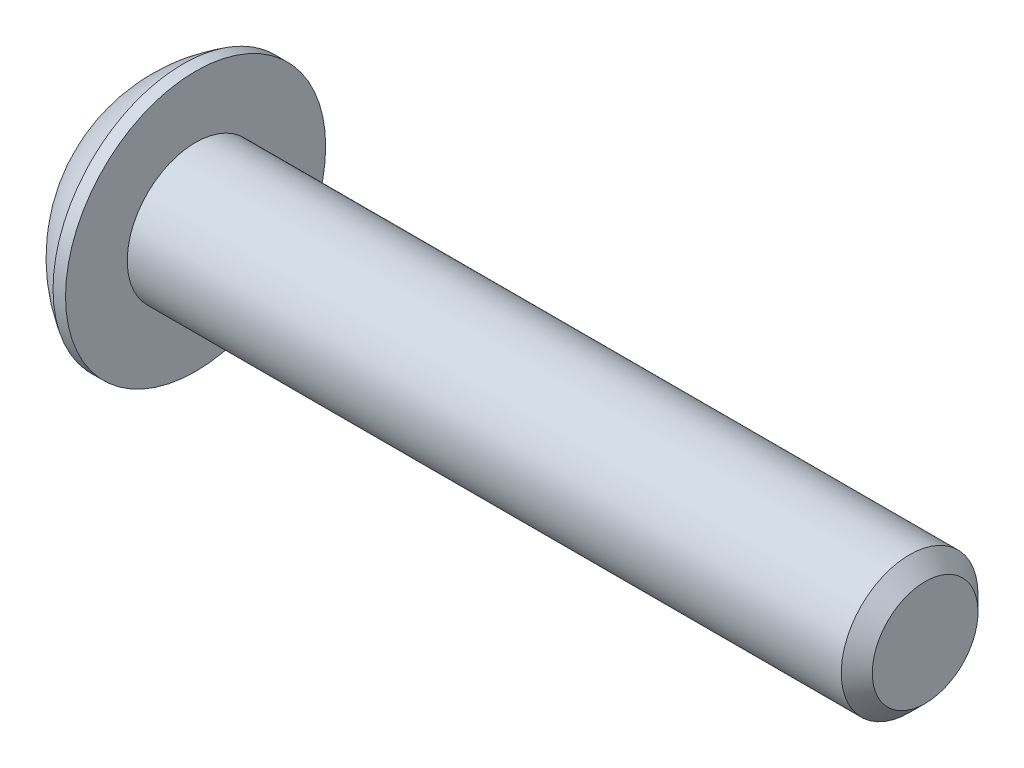
ISO-10303-21;
HEADER;
FILE_DESCRIPTION(('STEP AP214'),'2;1');
FILE_NAME('part.step','',(''),(''),'','','');
FILE_SCHEMA(('AUTOMOTIVE_DESIGN { 1 0 10303 214 1 1 1 1 }'));
ENDSEC;
DATA;
#1=APPLICATION_CONTEXT('core data for automotive mechanical design processes');
#2=APPLICATION_PROTOCOL_DEFINITION('international standard','automotive_design',2000,#1);
#3=PRODUCT_CONTEXT('',#1,'mechanical');
#4=PRODUCT('Part','Part','',(#3));
#5=PRODUCT_RELATED_PRODUCT_CATEGORY('part','',(#4));
#6=PRODUCT_DEFINITION_FORMATION('','',#4);
#7=PRODUCT_DEFINITION_CONTEXT('part definition',#1,'design');
#8=PRODUCT_DEFINITION('design','',#6,#7);
#9=PRODUCT_DEFINITION_SHAPE('','',#8);
#10=(LENGTH_UNIT() NAMED_UNIT(*) SI_UNIT(.MILLI.,.METRE.));
#11=(NAMED_UNIT(*) PLANE_ANGLE_UNIT() SI_UNIT($,.RADIAN.));
#12=(NAMED_UNIT(*) SI_UNIT($,.STERADIAN.) SOLID_ANGLE_UNIT());
#13=UNCERTAINTY_MEASURE_WITH_UNIT(LENGTH_MEASURE(1.E-05),#10,'distance_accuracy_value','');
#14=(GEOMETRIC_REPRESENTATION_CONTEXT(3) GLOBAL_UNCERTAINTY_ASSIGNED_CONTEXT((#13)) GLOBAL_UNIT_ASSIGNED_CONTEXT((#10,
#11,#12)) REPRESENTATION_CONTEXT('',''));
#15=CARTESIAN_POINT('',(0.,0.,0.));
#16=DIRECTION('',(0.,0.,1.));
#17=DIRECTION('',(1.,0.,0.));
#18=AXIS2_PLACEMENT_3D('',#15,#16,#17);
#19=CARTESIAN_POINT('',(1.32080000000034,0.,0.));
#20=DIRECTION('',(-1.,0.,0.));
#21=DIRECTION('',(0.,0.,-1.));
#22=AXIS2_PLACEMENT_3D('',#19,#20,#21);
#23=CONICAL_SURFACE('',#22,1.1937999999998,1.04719755119608);
#24=CARTESIAN_POINT('',(2.01004075135902,0.,-4.44089209850063E-13));
#25=VERTEX_POINT('',#24);
#26=VERTEX_LOOP('',#25);
#27=FACE_BOUND('',#26,.T.);
#28=CARTESIAN_POINT('',(1.32080000000009,0.,0.));
#29=DIRECTION('',(1.,0.,0.));
#30=DIRECTION('',(0.,0.,-1.));
#31=AXIS2_PLACEMENT_3D('',#28,#29,#30);
#32=CIRCLE('',#31,1.19380000000024);
#33=CARTESIAN_POINT('',(1.32080000000004,-1.03386112703797,-0.59690000000006));
#34=VERTEX_POINT('',#33);
#35=CARTESIAN_POINT('',(1.32080000000004,0.,-1.19380000000012));
#36=VERTEX_POINT('',#35);
#37=EDGE_CURVE('E37',#34,#36,#32,.T.);
#38=ORIENTED_EDGE('',*,*,#37,.F.);
#39=CARTESIAN_POINT('',(1.32080000000009,0.,0.));
#40=DIRECTION('',(1.,0.,0.));
#41=DIRECTION('',(0.,0.,-1.));
#42=AXIS2_PLACEMENT_3D('',#39,#40,#41);
#43=CIRCLE('',#42,1.19380000000024);
#44=CARTESIAN_POINT('',(1.32080000000004,-1.03386112703797,0.59690000000006));
#45=VERTEX_POINT('',#44);
#46=EDGE_CURVE('E127',#45,#34,#43,.T.);
#47=ORIENTED_EDGE('',*,*,#46,.F.);
#48=CARTESIAN_POINT('',(1.32080000000009,0.,0.));
#49=DIRECTION('',(1.,0.,0.));
#50=DIRECTION('',(0.,0.,-1.));
#51=AXIS2_PLACEMENT_3D('',#48,#49,#50);
#52=CIRCLE('',#51,1.19380000000024);
#53=CARTESIAN_POINT('',(1.32080000000004,1.49457637585666E-12,1.19380000000012));
#54=VERTEX_POINT('',#53);
#55=EDGE_CURVE('E133',#54,#45,#52,.T.);
#56=ORIENTED_EDGE('',*,*,#55,.F.);
#57=CARTESIAN_POINT('',(1.32080000000009,0.,0.));
#58=DIRECTION('',(1.,0.,0.));
#59=DIRECTION('',(0.,0.,-1.));
#60=AXIS2_PLACEMENT_3D('',#57,#58,#59);
#61=CIRCLE('',#60,1.19380000000024);
#62=CARTESIAN_POINT('',(1.32080000000004,1.03386112703797,0.596900000000061));
#63=VERTEX_POINT('',#62);
#64=EDGE_CURVE('E147',#63,#54,#61,.T.);
#65=ORIENTED_EDGE('',*,*,#64,.F.);
#66=CARTESIAN_POINT('',(1.32080000000009,0.,0.));
#67=DIRECTION('',(1.,0.,0.));
#68=DIRECTION('',(0.,0.,-1.));
#69=AXIS2_PLACEMENT_3D('',#66,#67,#68);
#70=CIRCLE('',#69,1.19380000000024);
#71=CARTESIAN_POINT('',(1.32080000000004,1.03386112703797,-0.596900000000061));
#72=VERTEX_POINT('',#71);
#73=EDGE_CURVE('E140',#72,#63,#70,.T.);
#74=ORIENTED_EDGE('',*,*,#73,.F.);
#75=CARTESIAN_POINT('',(1.32080000000009,0.,0.));
#76=DIRECTION('',(1.,0.,0.));
#77=DIRECTION('',(0.,0.,-1.));
#78=AXIS2_PLACEMENT_3D('',#75,#76,#77);
#79=CIRCLE('',#78,1.19380000000024);
#80=EDGE_CURVE('E137',#36,#72,#79,.T.);
#81=ORIENTED_EDGE('',*,*,#80,.F.);
#82=EDGE_LOOP('',(#38,#47,#56,#65,#74,#81));
#83=FACE_BOUND('',#82,.T.);
#84=ADVANCED_FACE('F34',(#27,#83),#23,.F.);
#85=CARTESIAN_POINT('',(1.3208,-2.06772225407572,1.1938));
#86=DIRECTION('',(1.,0.,0.));
#87=DIRECTION('',(0.,0.,1.));
#88=AXIS2_PLACEMENT_3D('',#85,#86,#87);
#89=PLANE('',#88);
#90=DIRECTION('',(0.,0.5,-0.866025403784439));
#91=VECTOR('',#90,1.);
#92=CARTESIAN_POINT('',(1.3208,-1.37848150271715,0.));
#93=LINE('',#92,#91);
#94=CARTESIAN_POINT('',(1.3208,-0.689240751358574,-1.1938));
#95=VERTEX_POINT('',#94);
#96=EDGE_CURVE('E109',#95,#34,#93,.F.);
#97=ORIENTED_EDGE('',*,*,#96,.T.);
#98=ORIENTED_EDGE('',*,*,#37,.T.);
#99=DIRECTION('',(0.,1.,0.));
#100=VECTOR('',#99,1.);
#101=CARTESIAN_POINT('',(1.3208,-0.689240751358574,-1.1938));
#102=LINE('',#101,#100);
#103=EDGE_CURVE('E124',#36,#95,#102,.F.);
#104=ORIENTED_EDGE('',*,*,#103,.T.);
#105=EDGE_LOOP('',(#97,#98,#104));
#106=FACE_BOUND('',#105,.T.);
#107=ADVANCED_FACE('F121',(#106),#89,.F.);
#108=CARTESIAN_POINT('',(1.3208,-2.06772225407572,1.1938));
#109=DIRECTION('',(1.,0.,0.));
#110=DIRECTION('',(0.,0.,1.));
#111=AXIS2_PLACEMENT_3D('',#108,#109,#110);
#112=PLANE('',#111);
#113=DIRECTION('',(0.,-0.5,-0.866025403784439));
#114=VECTOR('',#113,1.);
#115=CARTESIAN_POINT('',(1.3208,-0.689240751358574,1.1938));
#116=LINE('',#115,#114);
#117=CARTESIAN_POINT('',(1.3208,-1.37848150271715,0.));
#118=VERTEX_POINT('',#117);
#119=EDGE_CURVE('E129',#118,#45,#116,.F.);
#120=ORIENTED_EDGE('',*,*,#119,.T.);
#121=ORIENTED_EDGE('',*,*,#46,.T.);
#122=DIRECTION('',(0.,0.5,-0.866025403784439));
#123=VECTOR('',#122,1.);
#124=CARTESIAN_POINT('',(1.3208,-1.37848150271715,0.));
#125=LINE('',#124,#123);
#126=EDGE_CURVE('E104',#34,#118,#125,.F.);
#127=ORIENTED_EDGE('',*,*,#126,.T.);
#128=EDGE_LOOP('',(#120,#121,#127));
#129=FACE_BOUND('',#128,.T.);
#130=ADVANCED_FACE('F128',(#129),#112,.F.);
#131=CARTESIAN_POINT('',(1.3208,-2.06772225407572,1.1938));
#132=DIRECTION('',(1.,0.,0.));
#133=DIRECTION('',(0.,0.,1.));
#134=AXIS2_PLACEMENT_3D('',#131,#132,#133);
#135=PLANE('',#134);
#136=DIRECTION('',(0.,1.,0.));
#137=VECTOR('',#136,1.);
#138=CARTESIAN_POINT('',(1.3208,0.689240751358577,1.1938));
#139=LINE('',#138,#137);
#140=CARTESIAN_POINT('',(1.3208,-0.689240751358574,1.1938));
#141=VERTEX_POINT('',#140);
#142=EDGE_CURVE('E166',#141,#54,#139,.T.);
#143=ORIENTED_EDGE('',*,*,#142,.T.);
#144=ORIENTED_EDGE('',*,*,#55,.T.);
#145=DIRECTION('',(0.,-0.5,-0.866025403784439));
#146=VECTOR('',#145,1.);
#147=CARTESIAN_POINT('',(1.3208,-0.689240751358574,1.1938));
#148=LINE('',#147,#146);
#149=EDGE_CURVE('E164',#45,#141,#148,.F.);
#150=ORIENTED_EDGE('',*,*,#149,.T.);
#151=EDGE_LOOP('',(#143,#144,#150));
#152=FACE_BOUND('',#151,.T.);
#153=ADVANCED_FACE('F163',(#152),#135,.F.);
#154=CARTESIAN_POINT('',(1.3208,-2.06772225407572,1.1938));
#155=DIRECTION('',(1.,0.,0.));
#156=DIRECTION('',(0.,0.,1.));
#157=AXIS2_PLACEMENT_3D('',#154,#155,#156);
#158=PLANE('',#157);
#159=DIRECTION('',(0.,-0.5,0.866025403784439));
#160=VECTOR('',#159,1.);
#161=CARTESIAN_POINT('',(1.3208,1.37848150271715,0.));
#162=LINE('',#161,#160);
#163=CARTESIAN_POINT('',(1.3208,0.689240751358577,1.1938));
#164=VERTEX_POINT('',#163);
#165=EDGE_CURVE('E173',#164,#63,#162,.F.);
#166=ORIENTED_EDGE('',*,*,#165,.T.);
#167=ORIENTED_EDGE('',*,*,#64,.T.);
#168=DIRECTION('',(0.,1.,0.));
#169=VECTOR('',#168,1.);
#170=CARTESIAN_POINT('',(1.3208,0.689240751358577,1.1938));
#171=LINE('',#170,#169);
#172=EDGE_CURVE('E171',#54,#164,#171,.T.);
#173=ORIENTED_EDGE('',*,*,#172,.T.);
#174=EDGE_LOOP('',(#166,#167,#173));
#175=FACE_BOUND('',#174,.T.);
#176=ADVANCED_FACE('F170',(#175),#158,.F.);
#177=CARTESIAN_POINT('',(1.3208,-2.06772225407572,1.1938));
#178=DIRECTION('',(1.,0.,0.));
#179=DIRECTION('',(0.,0.,1.));
#180=AXIS2_PLACEMENT_3D('',#177,#178,#179);
#181=PLANE('',#180);
#182=DIRECTION('',(0.,0.5,0.866025403784439));
#183=VECTOR('',#182,1.);
#184=CARTESIAN_POINT('',(1.3208,0.689240751358576,-1.1938));
#185=LINE('',#184,#183);
#186=CARTESIAN_POINT('',(1.3208,1.37848150271715,0.));
#187=VERTEX_POINT('',#186);
#188=EDGE_CURVE('E184',#187,#72,#185,.F.);
#189=ORIENTED_EDGE('',*,*,#188,.T.);
#190=ORIENTED_EDGE('',*,*,#73,.T.);
#191=DIRECTION('',(0.,-0.5,0.866025403784439));
#192=VECTOR('',#191,1.);
#193=CARTESIAN_POINT('',(1.3208,1.37848150271715,0.));
#194=LINE('',#193,#192);
#195=EDGE_CURVE('E176',#63,#187,#194,.F.);
#196=ORIENTED_EDGE('',*,*,#195,.T.);
#197=EDGE_LOOP('',(#189,#190,#196));
#198=FACE_BOUND('',#197,.T.);
#199=ADVANCED_FACE('F182',(#198),#181,.F.);
#200=CARTESIAN_POINT('',(1.3208,-2.06772225407572,1.1938));
#201=DIRECTION('',(1.,0.,0.));
#202=DIRECTION('',(0.,0.,1.));
#203=AXIS2_PLACEMENT_3D('',#200,#201,#202);
#204=PLANE('',#203);
#205=DIRECTION('',(0.,1.,0.));
#206=VECTOR('',#205,1.);
#207=CARTESIAN_POINT('',(1.3208,-0.689240751358574,-1.1938));
#208=LINE('',#207,#206);
#209=CARTESIAN_POINT('',(1.3208,0.689240751358576,-1.1938));
#210=VERTEX_POINT('',#209);
#211=EDGE_CURVE('E144',#210,#36,#208,.F.);
#212=ORIENTED_EDGE('',*,*,#211,.T.);
#213=ORIENTED_EDGE('',*,*,#80,.T.);
#214=DIRECTION('',(0.,0.5,0.866025403784439));
#215=VECTOR('',#214,1.);
#216=CARTESIAN_POINT('',(1.3208,0.689240751358576,-1.1938));
#217=LINE('',#216,#215);
#218=EDGE_CURVE('E186',#72,#210,#217,.F.);
#219=ORIENTED_EDGE('',*,*,#218,.T.);
#220=EDGE_LOOP('',(#212,#213,#219));
#221=FACE_BOUND('',#220,.T.);
#222=ADVANCED_FACE('F307',(#221),#204,.F.);
#223=CARTESIAN_POINT('',(1.3208,-0.689240751358574,-1.1938));
#224=DIRECTION('',(0.,0.,1.));
#225=DIRECTION('',(0.,1.,0.));
#226=AXIS2_PLACEMENT_3D('',#223,#224,#225);
#227=PLANE('',#226);
#228=DIRECTION('',(0.,1.,0.));
#229=VECTOR('',#228,1.);
#230=CARTESIAN_POINT('',(0.,0.,-1.1938));
#231=LINE('',#230,#229);
#232=CARTESIAN_POINT('',(0.,0.689240751358577,-1.1938));
#233=VERTEX_POINT('',#232);
#234=CARTESIAN_POINT('',(0.,-0.689240751358574,-1.1938));
#235=VERTEX_POINT('',#234);
#236=EDGE_CURVE('E194',#233,#235,#231,.F.);
#237=ORIENTED_EDGE('',*,*,#236,.T.);
#238=DIRECTION('',(1.,0.,0.));
#239=VECTOR('',#238,1.);
#240=CARTESIAN_POINT('',(1.3208,-0.689240751358574,-1.1938));
#241=LINE('',#240,#239);
#242=EDGE_CURVE('E116',#235,#95,#241,.T.);
#243=ORIENTED_EDGE('',*,*,#242,.T.);
#244=ORIENTED_EDGE('',*,*,#103,.F.);
#245=ORIENTED_EDGE('',*,*,#211,.F.);
#246=DIRECTION('',(1.,0.,0.));
#247=VECTOR('',#246,1.);
#248=CARTESIAN_POINT('',(1.3208,0.689240751358576,-1.1938));
#249=LINE('',#248,#247);
#250=EDGE_CURVE('E189',#210,#233,#249,.F.);
#251=ORIENTED_EDGE('',*,*,#250,.T.);
#252=EDGE_LOOP('',(#237,#243,#244,#245,#251));
#253=FACE_BOUND('',#252,.T.);
#254=ADVANCED_FACE('F273',(#253),#227,.T.);
#255=CARTESIAN_POINT('',(1.3208,-1.37848150271715,0.));
#256=DIRECTION('',(0.,0.866025403784439,0.5));
#257=DIRECTION('',(0.,0.5,-0.866025403784439));
#258=AXIS2_PLACEMENT_3D('',#255,#256,#257);
#259=PLANE('',#258);
#260=DIRECTION('',(0.,-0.5,0.866025403784439));
#261=VECTOR('',#260,1.);
#262=CARTESIAN_POINT('',(0.,-0.689240751358574,-1.1938));
#263=LINE('',#262,#261);
#264=CARTESIAN_POINT('',(0.,-1.37848150271715,0.));
#265=VERTEX_POINT('',#264);
#266=EDGE_CURVE('E270',#235,#265,#263,.T.);
#267=ORIENTED_EDGE('',*,*,#266,.T.);
#268=DIRECTION('',(1.,0.,0.));
#269=VECTOR('',#268,1.);
#270=CARTESIAN_POINT('',(1.3208,-1.37848150271715,0.));
#271=LINE('',#270,#269);
#272=EDGE_CURVE('E111',#265,#118,#271,.T.);
#273=ORIENTED_EDGE('',*,*,#272,.T.);
#274=ORIENTED_EDGE('',*,*,#126,.F.);
#275=ORIENTED_EDGE('',*,*,#96,.F.);
#276=ORIENTED_EDGE('',*,*,#242,.F.);
#277=EDGE_LOOP('',(#267,#273,#274,#275,#276));
#278=FACE_BOUND('',#277,.T.);
#279=ADVANCED_FACE('F107',(#278),#259,.T.);
#280=CARTESIAN_POINT('',(1.3208,-0.689240751358574,1.1938));
#281=DIRECTION('',(0.,0.866025403784439,-0.5));
#282=DIRECTION('',(0.,-0.5,-0.866025403784439));
#283=AXIS2_PLACEMENT_3D('',#280,#281,#282);
#284=PLANE('',#283);
#285=DIRECTION('',(0.,0.5,0.866025403784439));
#286=VECTOR('',#285,1.);
#287=CARTESIAN_POINT('',(0.,-1.37848150271715,0.));
#288=LINE('',#287,#286);
#289=CARTESIAN_POINT('',(0.,-0.689240751358574,1.1938));
#290=VERTEX_POINT('',#289);
#291=EDGE_CURVE('E268',#265,#290,#288,.T.);
#292=ORIENTED_EDGE('',*,*,#291,.T.);
#293=DIRECTION('',(1.,0.,0.));
#294=VECTOR('',#293,1.);
#295=CARTESIAN_POINT('',(1.3208,-0.689240751358574,1.1938));
#296=LINE('',#295,#294);
#297=EDGE_CURVE('E177',#290,#141,#296,.T.);
#298=ORIENTED_EDGE('',*,*,#297,.T.);
#299=ORIENTED_EDGE('',*,*,#149,.F.);
#300=ORIENTED_EDGE('',*,*,#119,.F.);
#301=ORIENTED_EDGE('',*,*,#272,.F.);
#302=EDGE_LOOP('',(#292,#298,#299,#300,#301));
#303=FACE_BOUND('',#302,.T.);
#304=ADVANCED_FACE('F278',(#303),#284,.T.);
#305=CARTESIAN_POINT('',(1.3208,0.689240751358577,1.1938));
#306=DIRECTION('',(0.,0.,-1.));
#307=DIRECTION('',(1.,0.,0.));
#308=AXIS2_PLACEMENT_3D('',#305,#306,#307);
#309=PLANE('',#308);
#310=DIRECTION('',(0.,1.,0.));
#311=VECTOR('',#310,1.);
#312=CARTESIAN_POINT('',(0.,0.,1.1938));
#313=LINE('',#312,#311);
#314=CARTESIAN_POINT('',(0.,0.689240751358577,1.1938));
#315=VERTEX_POINT('',#314);
#316=EDGE_CURVE('E260',#290,#315,#313,.T.);
#317=ORIENTED_EDGE('',*,*,#316,.T.);
#318=DIRECTION('',(1.,0.,0.));
#319=VECTOR('',#318,1.);
#320=CARTESIAN_POINT('',(1.3208,0.689240751358577,1.1938));
#321=LINE('',#320,#319);
#322=EDGE_CURVE('E187',#315,#164,#321,.T.);
#323=ORIENTED_EDGE('',*,*,#322,.T.);
#324=ORIENTED_EDGE('',*,*,#172,.F.);
#325=ORIENTED_EDGE('',*,*,#142,.F.);
#326=ORIENTED_EDGE('',*,*,#297,.F.);
#327=EDGE_LOOP('',(#317,#323,#324,#325,#326));
#328=FACE_BOUND('',#327,.T.);
#329=ADVANCED_FACE('F280',(#328),#309,.T.);
#330=CARTESIAN_POINT('',(1.3208,1.37848150271715,0.));
#331=DIRECTION('',(0.,-0.866025403784439,-0.5));
#332=DIRECTION('',(0.,-0.5,0.866025403784439));
#333=AXIS2_PLACEMENT_3D('',#330,#331,#332);
#334=PLANE('',#333);
#335=DIRECTION('',(0.,0.5,-0.866025403784439));
#336=VECTOR('',#335,1.);
#337=CARTESIAN_POINT('',(0.,0.689240751358577,1.1938));
#338=LINE('',#337,#336);
#339=CARTESIAN_POINT('',(0.,1.37848150271715,0.));
#340=VERTEX_POINT('',#339);
#341=EDGE_CURVE('E257',#315,#340,#338,.T.);
#342=ORIENTED_EDGE('',*,*,#341,.T.);
#343=DIRECTION('',(1.,0.,0.));
#344=VECTOR('',#343,1.);
#345=CARTESIAN_POINT('',(1.3208,1.37848150271715,0.));
#346=LINE('',#345,#344);
#347=EDGE_CURVE('E202',#340,#187,#346,.T.);
#348=ORIENTED_EDGE('',*,*,#347,.T.);
#349=ORIENTED_EDGE('',*,*,#195,.F.);
#350=ORIENTED_EDGE('',*,*,#165,.F.);
#351=ORIENTED_EDGE('',*,*,#322,.F.);
#352=EDGE_LOOP('',(#342,#348,#349,#350,#351));
#353=FACE_BOUND('',#352,.T.);
#354=ADVANCED_FACE('F281',(#353),#334,.T.);
#355=CARTESIAN_POINT('',(1.3208,0.689240751358576,-1.1938));
#356=DIRECTION('',(0.,-0.866025403784439,0.5));
#357=DIRECTION('',(0.,0.5,0.866025403784439));
#358=AXIS2_PLACEMENT_3D('',#355,#356,#357);
#359=PLANE('',#358);
#360=DIRECTION('',(0.,-0.5,-0.866025403784439));
#361=VECTOR('',#360,1.);
#362=CARTESIAN_POINT('',(0.,1.37848150271715,0.));
#363=LINE('',#362,#361);
#364=EDGE_CURVE('E52',#340,#233,#363,.T.);
#365=ORIENTED_EDGE('',*,*,#364,.T.);
#366=ORIENTED_EDGE('',*,*,#250,.F.);
#367=ORIENTED_EDGE('',*,*,#218,.F.);
#368=ORIENTED_EDGE('',*,*,#188,.F.);
#369=ORIENTED_EDGE('',*,*,#347,.F.);
#370=EDGE_LOOP('',(#365,#366,#367,#368,#369));
#371=FACE_BOUND('',#370,.T.);
#372=ADVANCED_FACE('F282',(#371),#359,.T.);
#373=CARTESIAN_POINT('',(0.,0.,0.));
#374=DIRECTION('',(-1.,0.,0.));
#375=DIRECTION('',(0.,0.,-1.));
#376=AXIS2_PLACEMENT_3D('',#373,#374,#375);
#377=PLANE('',#376);
#378=ORIENTED_EDGE('',*,*,#341,.F.);
#379=ORIENTED_EDGE('',*,*,#316,.F.);
#380=ORIENTED_EDGE('',*,*,#291,.F.);
#381=ORIENTED_EDGE('',*,*,#266,.F.);
#382=ORIENTED_EDGE('',*,*,#236,.F.);
#383=ORIENTED_EDGE('',*,*,#364,.F.);
#384=EDGE_LOOP('',(#378,#379,#380,#381,#382,#383));
#385=FACE_BOUND('',#384,.T.);
#386=CARTESIAN_POINT('',(0.,1.9812,0.));
#387=CARTESIAN_POINT('',(0.,1.9811996664299,-0.0556258831179428));
#388=CARTESIAN_POINT('',(0.,1.97885520380442,-0.111261989398606));
#389=CARTESIAN_POINT('',(0.,1.96949260169541,-0.222149719830458));
#390=CARTESIAN_POINT('',(0.,1.96247308239605,-0.277401225602895));
#391=CARTESIAN_POINT('',(0.,1.94379192841038,-0.387209508139747));
#392=CARTESIAN_POINT('',(-1.85325793235264E-13,1.93212292489526,-0.441765039546365));
#393=CARTESIAN_POINT('',(1.86344214223505E-13,1.90422331175315,-0.549729449347493));
#394=CARTESIAN_POINT('',(6.94543371897454E-13,1.88798900035338,-0.603137359208869));
#395=CARTESIAN_POINT('',(1.15501975216981E-12,1.83266214476501,-0.760839131321828));
#396=CARTESIAN_POINT('',(0.,1.78690023648845,-0.862876433575429));
#397=CARTESIAN_POINT('',(0.,1.67887358150667,-1.05780719540872));
#398=CARTESIAN_POINT('',(9.54193214892627E-13,1.6166082074585,-1.15070030720801));
#399=CARTESIAN_POINT('',(5.94805591894675E-13,1.51224157140982,-1.28116890915697));
#400=CARTESIAN_POINT('',(1.63221293851378E-13,1.4755970394354,-1.32320451127026));
#401=CARTESIAN_POINT('',(-1.62196980336157E-13,1.39893832619713,-1.40400288695709));
#402=CARTESIAN_POINT('',(0.,1.35892742784698,-1.44276877695455));
#403=CARTESIAN_POINT('',(1.14362537325405E-13,1.23416504602197,-1.55382272417904));
#404=CARTESIAN_POINT('',(0.,1.14466125559859,-1.62089527952111));
#405=CARTESIAN_POINT('',(0.,0.955712144178167,-1.7390221808118));
#406=CARTESIAN_POINT('',(0.,0.856267198233564,-1.79007713076007));
#407=CARTESIAN_POINT('',(0.,0.650206345910843,-1.87477637530954));
#408=CARTESIAN_POINT('',(0.,0.543590516134855,-1.90842085586267));
#409=CARTESIAN_POINT('',(0.,0.326226155292018,-1.95733039300656));
#410=CARTESIAN_POINT('',(0.,0.21547760215793,-1.97259535144288));
#411=CARTESIAN_POINT('',(0.,-0.00701040587544633,-1.98431697865418));
#412=CARTESIAN_POINT('',(0.,-0.118749860774734,-1.98077364742917));
#413=CARTESIAN_POINT('',(0.,-0.340050178355485,-1.95497485623825));
#414=CARTESIAN_POINT('',(0.,-0.449611052668256,-1.93271949620218));
#415=CARTESIAN_POINT('',(0.,-0.663431110729174,-1.87014138774524));
#416=CARTESIAN_POINT('',(0.,-0.76769023783852,-1.82981844635272));
#417=CARTESIAN_POINT('',(0.,-0.968005760719347,-1.73219968377096));
#418=CARTESIAN_POINT('',(0.,-1.0640618469811,-1.6749032225164));
#419=CARTESIAN_POINT('',(0.,-1.19980276751283,-1.57757371205873));
#420=CARTESIAN_POINT('',(0.,-1.24366557129213,-1.54322665019466));
#421=CARTESIAN_POINT('',(0.,-1.32838995706696,-1.47093063174264));
#422=CARTESIAN_POINT('',(0.,-1.36924860178706,-1.43297823102439));
#423=CARTESIAN_POINT('',(0.,-1.48674671849223,-1.31419842051173));
#424=CARTESIAN_POINT('',(0.,-1.55842832343237,-1.22836221289311));
#425=CARTESIAN_POINT('',(0.,-1.6863396856475,-1.04586168272493));
#426=CARTESIAN_POINT('',(0.,-1.7425700302488,-0.949197771949775));
#427=CARTESIAN_POINT('',(0.,-1.8141614250401,-0.798182600298684));
#428=CARTESIAN_POINT('',(0.,-1.83591780585875,-0.74677620384779));
#429=CARTESIAN_POINT('',(0.,-1.87500754181092,-0.642341081688635));
#430=CARTESIAN_POINT('',(0.,-1.89234447645404,-0.589313708122846));
#431=CARTESIAN_POINT('',(0.,-1.92246053433555,-0.482076273028395));
#432=CARTESIAN_POINT('',(0.,-1.93524685475118,-0.42786822425751));
#433=CARTESIAN_POINT('',(0.,-1.95620937250494,-0.318578151844611));
#434=CARTESIAN_POINT('',(0.,-1.96438692958147,-0.263496390912872));
#435=CARTESIAN_POINT('',(0.,-1.97388528284653,-0.173607715038558));
#436=CARTESIAN_POINT('',(0.,-1.97662743364426,-0.138944718024998));
#437=CARTESIAN_POINT('',(0.,-1.98028489645283,-0.0695224782567002));
#438=CARTESIAN_POINT('',(0.,-1.98120020846367,-0.0347632355019631));
#439=CARTESIAN_POINT('',(0.,-1.9811996664299,0.0556258831179437));
#440=CARTESIAN_POINT('',(0.,-1.97885520380442,0.111261989398607));
#441=CARTESIAN_POINT('',(0.,-1.96949260169541,0.222149719830459));
#442=CARTESIAN_POINT('',(0.,-1.96247308239606,0.277401225602897));
#443=CARTESIAN_POINT('',(0.,-1.94379192841039,0.38720950813975));
#444=CARTESIAN_POINT('',(-1.85269749640692E-13,-1.93212292489526,0.441765039546367));
#445=CARTESIAN_POINT('',(1.86288125054388E-13,-1.90422331175315,0.549729449347495));
#446=CARTESIAN_POINT('',(6.94525090263764E-13,-1.88798900035338,0.603137359208872));
#447=CARTESIAN_POINT('',(1.15505622829081E-12,-1.83266214476501,0.760839131321831));
#448=CARTESIAN_POINT('',(0.,-1.78690023648845,0.862876433575431));
#449=CARTESIAN_POINT('',(0.,-1.67887358150667,1.05780719540872));
#450=CARTESIAN_POINT('',(9.5424881286938E-13,-1.6166082074585,1.15070030720801));
#451=CARTESIAN_POINT('',(5.94777756479239E-13,-1.51224157140982,1.28116890915698));
#452=CARTESIAN_POINT('',(1.63138949183833E-13,-1.47559703943539,1.32320451127027));
#453=CARTESIAN_POINT('',(-1.62114715061273E-13,-1.39893832619713,1.40400288695709));
#454=CARTESIAN_POINT('',(0.,-1.35892742784699,1.44276877695455));
#455=CARTESIAN_POINT('',(1.13760489124207E-13,-1.23416504602197,1.55382272417904));
#456=CARTESIAN_POINT('',(0.,-1.14466125559859,1.62089527952111));
#457=CARTESIAN_POINT('',(0.,-0.95571214417816,1.73902218081179));
#458=CARTESIAN_POINT('',(0.,-0.856267198233559,1.79007713076007));
#459=CARTESIAN_POINT('',(0.,-0.65020634591084,1.87477637530954));
#460=CARTESIAN_POINT('',(0.,-0.543590516134854,1.90842085586267));
#461=CARTESIAN_POINT('',(0.,-0.326226155292018,1.95733039300657));
#462=CARTESIAN_POINT('',(0.,-0.215477602157929,1.97259535144288));
#463=CARTESIAN_POINT('',(0.,0.00701040587544865,1.98431697865418));
#464=CARTESIAN_POINT('',(0.,0.118749860774737,1.98077364742916));
#465=CARTESIAN_POINT('',(0.,0.340050178355489,1.95497485623824));
#466=CARTESIAN_POINT('',(0.,0.44961105266826,1.93271949620218));
#467=CARTESIAN_POINT('',(0.,0.663431110729178,1.87014138774524));
#468=CARTESIAN_POINT('',(0.,0.767690237838524,1.82981844635272));
#469=CARTESIAN_POINT('',(0.,0.968005760719347,1.73219968377096));
#470=CARTESIAN_POINT('',(0.,1.0640618469811,1.67490322251639));
#471=CARTESIAN_POINT('',(0.,1.19980276751283,1.57757371205873));
#472=CARTESIAN_POINT('',(0.,1.24366557129214,1.54322665019465));
#473=CARTESIAN_POINT('',(0.,1.32838995706696,1.47093063174263));
#474=CARTESIAN_POINT('',(0.,1.36924860178706,1.43297823102439));
#475=CARTESIAN_POINT('',(0.,1.48674671849223,1.31419842051172));
#476=CARTESIAN_POINT('',(0.,1.55842832343237,1.22836221289311));
#477=CARTESIAN_POINT('',(0.,1.6863396856475,1.04586168272492));
#478=CARTESIAN_POINT('',(0.,1.7425700302488,0.949197771949768));
#479=CARTESIAN_POINT('',(0.,1.8141614250401,0.798182600298677));
#480=CARTESIAN_POINT('',(0.,1.83591780585875,0.746776203847785));
#481=CARTESIAN_POINT('',(0.,1.87500754181092,0.64234108168863));
#482=CARTESIAN_POINT('',(0.,1.89234447645404,0.589313708122841));
#483=CARTESIAN_POINT('',(0.,1.92246053433555,0.482076273028389));
#484=CARTESIAN_POINT('',(0.,1.93524685475118,0.427868224257504));
#485=CARTESIAN_POINT('',(0.,1.95620937250494,0.318578151844605));
#486=CARTESIAN_POINT('',(0.,1.96438692958147,0.263496390912866));
#487=CARTESIAN_POINT('',(0.,1.97388528284653,0.173607715038553));
#488=CARTESIAN_POINT('',(0.,1.97662743364426,0.138944718024994));
#489=CARTESIAN_POINT('',(0.,1.98028489645283,0.0695224782566989));
#490=CARTESIAN_POINT('',(0.,1.98120020846367,0.034763235501963));
#491=CARTESIAN_POINT('',(0.,1.9812,0.));
#492=B_SPLINE_CURVE_WITH_KNOTS('',3,(#386,#387,#388,#389,#390,#391,#392,#393,#394,#395,#396,
#397,#398,#399,#400,#401,#402,#403,#404,#405,#406,#407,#408,#409,#410,#411,#412,#413,#414,#415,
#416,#417,#418,#419,#420,#421,#422,#423,#424,#425,#426,#427,#428,#429,#430,#431,#432,#433,#434,
#435,#436,#437,#438,#439,#440,#441,#442,#443,#444,#445,#446,#447,#448,#449,#450,#451,#452,#453,
#454,#455,#456,#457,#458,#459,#460,#461,#462,#463,#464,#465,#466,#467,#468,#469,#470,#471,#472,
#473,#474,#475,#476,#477,#478,#479,#480,#481,#482,#483,#484,#485,#486,#487,#488,#489,#490,#491),
.UNSPECIFIED.,.T.,.F.,(4,2,2,2,2,2,2,2,2,2,2,2,2,2,2,2,2,2,2,2,2,2,2,2,2,2,2,2,2,2,2,2,2,2,2,2,
2,2,2,2,2,2,2,2,2,2,2,2,2,2,2,2,4),(0.,0.166845646007828,0.333740557374255,0.500901034367693,
0.668197445942386,1.00199278686282,1.33580081809885,1.50292354032982,1.6698851310853,
2.00370118900129,2.33750465770544,2.67130456115909,3.00510624723801,3.33890793331696,
3.67270783677065,4.00651130547476,4.34032736339026,4.50728895414554,4.67441167637632,
5.00821970761259,5.34201504853332,5.50931146010827,5.67647193710191,5.84336684846844,
6.0102124944764,6.11448220058334,6.21875190669029,6.38559755269812,6.55249246406454,
6.71965294105798,6.88694935263268,7.22074469355311,7.55455272478915,7.72167544702011,
7.88863703777559,8.22245309569158,8.55625656439573,8.89005646784938,9.2238581539283,
9.55765984000725,9.89145974346094,10.2252632121651,10.5590792700806,10.7260408608358,
10.8931635830666,11.2269716143029,11.5607669552236,11.7280633667986,11.8952238437922,
12.0621187551587,12.2289644011667,12.3332341072736,12.4375038133806),.UNSPECIFIED.);
#493=CARTESIAN_POINT('',(0.,1.9812,0.));
#494=VERTEX_POINT('',#493);
#495=EDGE_CURVE('E150',#494,#494,#492,.T.);
#496=ORIENTED_EDGE('',*,*,#495,.T.);
#497=EDGE_LOOP('',(#496));
#498=FACE_BOUND('',#497,.T.);
#499=ADVANCED_FACE('F275',(#385,#498),#377,.T.);
#500=CARTESIAN_POINT('',(4.13385,0.,0.));
#501=DIRECTION('',(0.,1.,0.));
#502=DIRECTION('',(1.,0.,0.));
#503=AXIS2_PLACEMENT_3D('',#500,#501,#502);
#504=SPHERICAL_SURFACE('',#503,4.58408870578439);
#505=CARTESIAN_POINT('',(1.8288,0.,0.));
#506=DIRECTION('',(1.,0.,0.));
#507=DIRECTION('',(0.,0.,-1.));
#508=AXIS2_PLACEMENT_3D('',#505,#506,#507);
#509=CIRCLE('',#508,3.9624);
#510=CARTESIAN_POINT('',(1.8288,0.,-3.9624));
#511=VERTEX_POINT('',#510);
#512=EDGE_CURVE('E250',#511,#511,#509,.F.);
#513=ORIENTED_EDGE('',*,*,#512,.T.);
#514=EDGE_LOOP('',(#513));
#515=FACE_BOUND('',#514,.T.);
#516=ORIENTED_EDGE('',*,*,#495,.F.);
#517=EDGE_LOOP('',(#516));
#518=FACE_BOUND('',#517,.T.);
#519=ADVANCED_FACE('F289',(#515,#518),#504,.T.);
#520=CARTESIAN_POINT('',(24.4348,0.,0.));
#521=DIRECTION('',(-1.,0.,0.));
#522=DIRECTION('',(0.,0.,-1.));
#523=AXIS2_PLACEMENT_3D('',#520,#521,#522);
#524=PLANE('',#523);
#525=CARTESIAN_POINT('',(24.4347999999945,0.,0.));
#526=DIRECTION('',(1.,0.,0.));
#527=DIRECTION('',(0.,-1.,0.));
#528=AXIS2_PLACEMENT_3D('',#525,#526,#527);
#529=CIRCLE('',#528,1.61035999991554);
#530=CARTESIAN_POINT('',(24.4347999999945,-1.61035999991554,0.));
#531=VERTEX_POINT('',#530);
#532=EDGE_CURVE('E248',#531,#531,#529,.T.);
#533=ORIENTED_EDGE('',*,*,#532,.T.);
#534=EDGE_LOOP('',(#533));
#535=FACE_BOUND('',#534,.T.);
#536=ADVANCED_FACE('F346',(#535),#524,.F.);
#537=CARTESIAN_POINT('',(0.,0.,0.));
#538=DIRECTION('',(-1.,0.,0.));
#539=DIRECTION('',(0.,0.,-1.));
#540=AXIS2_PLACEMENT_3D('',#537,#538,#539);
#541=CYLINDRICAL_SURFACE('',#540,3.9624);
#542=ORIENTED_EDGE('',*,*,#512,.F.);
#543=EDGE_LOOP('',(#542));
#544=FACE_BOUND('',#543,.T.);
#545=CARTESIAN_POINT('',(2.2098,0.,0.));
#546=DIRECTION('',(1.,0.,0.));
#547=DIRECTION('',(0.,0.,-1.));
#548=AXIS2_PLACEMENT_3D('',#545,#546,#547);
#549=CIRCLE('',#548,3.9624);
#550=CARTESIAN_POINT('',(2.2098,0.,-3.9624));
#551=VERTEX_POINT('',#550);
#552=EDGE_CURVE('E245',#551,#551,#549,.T.);
#553=ORIENTED_EDGE('',*,*,#552,.F.);
#554=EDGE_LOOP('',(#553));
#555=FACE_BOUND('',#554,.T.);
#556=ADVANCED_FACE('F354',(#544,#555),#541,.T.);
#557=CARTESIAN_POINT('',(23.9623599998708,0.,0.));
#558=DIRECTION('',(-1.,0.,0.));
#559=DIRECTION('',(0.,-1.,0.));
#560=AXIS2_PLACEMENT_3D('',#557,#558,#559);
#561=CONICAL_SURFACE('',#560,2.08280000003924,0.785398163397448);
#562=ORIENTED_EDGE('',*,*,#532,.F.);
#563=EDGE_LOOP('',(#562));
#564=FACE_BOUND('',#563,.T.);
#565=CARTESIAN_POINT('',(23.96236,0.,0.));
#566=DIRECTION('',(1.,0.,0.));
#567=DIRECTION('',(0.,0.,-1.));
#568=AXIS2_PLACEMENT_3D('',#565,#566,#567);
#569=CIRCLE('',#568,2.0828);
#570=CARTESIAN_POINT('',(23.96236,0.,-2.0828));
#571=VERTEX_POINT('',#570);
#572=EDGE_CURVE('E43',#571,#571,#569,.T.);
#573=ORIENTED_EDGE('',*,*,#572,.T.);
#574=EDGE_LOOP('',(#573));
#575=FACE_BOUND('',#574,.T.);
#576=ADVANCED_FACE('F364',(#564,#575),#561,.T.);
#577=CARTESIAN_POINT('',(2.2098,2.0828,0.));
#578=DIRECTION('',(-1.,0.,0.));
#579=DIRECTION('',(0.,0.,-1.));
#580=AXIS2_PLACEMENT_3D('',#577,#578,#579);
#581=PLANE('',#580);
#582=CARTESIAN_POINT('',(2.2098,0.,0.));
#583=DIRECTION('',(1.,0.,0.));
#584=DIRECTION('',(0.,0.,-1.));
#585=AXIS2_PLACEMENT_3D('',#582,#583,#584);
#586=CIRCLE('',#585,2.0828);
#587=CARTESIAN_POINT('',(2.2098,0.,-2.0828));
#588=VERTEX_POINT('',#587);
#589=EDGE_CURVE('E11',#588,#588,#586,.F.);
#590=ORIENTED_EDGE('',*,*,#589,.T.);
#591=EDGE_LOOP('',(#590));
#592=FACE_BOUND('',#591,.T.);
#593=ORIENTED_EDGE('',*,*,#552,.T.);
#594=EDGE_LOOP('',(#593));
#595=FACE_BOUND('',#594,.T.);
#596=ADVANCED_FACE('F374',(#592,#595),#581,.F.);
#597=CARTESIAN_POINT('',(0.,0.,0.));
#598=DIRECTION('',(-1.,0.,0.));
#599=DIRECTION('',(0.,0.,-1.));
#600=AXIS2_PLACEMENT_3D('',#597,#598,#599);
#601=CYLINDRICAL_SURFACE('',#600,2.0828);
#602=ORIENTED_EDGE('',*,*,#572,.F.);
#603=EDGE_LOOP('',(#602));
#604=FACE_BOUND('',#603,.T.);
#605=ORIENTED_EDGE('',*,*,#589,.F.);
#606=EDGE_LOOP('',(#605));
#607=FACE_BOUND('',#606,.T.);
#608=ADVANCED_FACE('F384',(#604,#607),#601,.T.);
#609=CLOSED_SHELL('',(#84,#107,#130,#153,#176,#199,#222,#254,#279,#304,#329,#354,#372,#499,#519,
#536,#556,#576,#596,#608));
#610=MANIFOLD_SOLID_BREP('B2',#609);
#611=ADVANCED_BREP_SHAPE_REPRESENTATION('',(#18,#610),#14);
#612=SHAPE_DEFINITION_REPRESENTATION(#9,#611);
ENDSEC;
END-ISO-10303-21;
